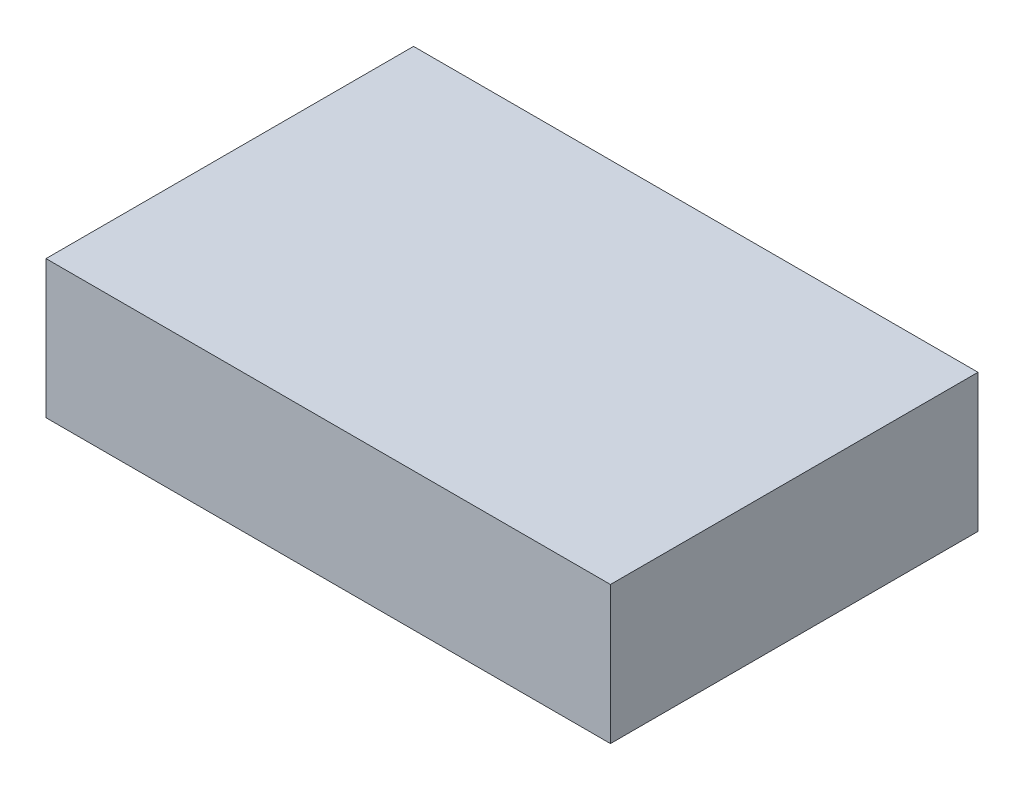
ISO-10303-21;
HEADER;
FILE_DESCRIPTION(('STEP AP214'),'2;1');
FILE_NAME('part.step','',(''),(''),'','','');
FILE_SCHEMA(('AUTOMOTIVE_DESIGN { 1 0 10303 214 1 1 1 1 }'));
ENDSEC;
DATA;
#1=APPLICATION_CONTEXT('core data for automotive mechanical design processes');
#2=APPLICATION_PROTOCOL_DEFINITION('international standard','automotive_design',2000,#1);
#3=PRODUCT_CONTEXT('',#1,'mechanical');
#4=PRODUCT('Part','Part','',(#3));
#5=PRODUCT_RELATED_PRODUCT_CATEGORY('part','',(#4));
#6=PRODUCT_DEFINITION_FORMATION('','',#4);
#7=PRODUCT_DEFINITION_CONTEXT('part definition',#1,'design');
#8=PRODUCT_DEFINITION('design','',#6,#7);
#9=PRODUCT_DEFINITION_SHAPE('','',#8);
#10=(LENGTH_UNIT() NAMED_UNIT(*) SI_UNIT(.MILLI.,.METRE.));
#11=(NAMED_UNIT(*) PLANE_ANGLE_UNIT() SI_UNIT($,.RADIAN.));
#12=(NAMED_UNIT(*) SI_UNIT($,.STERADIAN.) SOLID_ANGLE_UNIT());
#13=UNCERTAINTY_MEASURE_WITH_UNIT(LENGTH_MEASURE(1.E-05),#10,'distance_accuracy_value','');
#14=(GEOMETRIC_REPRESENTATION_CONTEXT(3) GLOBAL_UNCERTAINTY_ASSIGNED_CONTEXT((#13)) GLOBAL_UNIT_ASSIGNED_CONTEXT((#10,
#11,#12)) REPRESENTATION_CONTEXT('',''));
#15=CARTESIAN_POINT('',(0.,0.,0.));
#16=DIRECTION('',(0.,0.,1.));
#17=DIRECTION('',(1.,0.,0.));
#18=AXIS2_PLACEMENT_3D('',#15,#16,#17);
#19=CARTESIAN_POINT('',(43.,21.,28.));
#20=DIRECTION('',(-1.,0.,0.));
#21=DIRECTION('',(0.,0.,1.));
#22=AXIS2_PLACEMENT_3D('',#19,#20,#21);
#23=PLANE('',#22);
#24=DIRECTION('',(0.,0.,-1.));
#25=VECTOR('',#24,1.);
#26=CARTESIAN_POINT('',(43.,0.,28.));
#27=LINE('',#26,#25);
#28=CARTESIAN_POINT('',(43.,0.,28.));
#29=VERTEX_POINT('',#28);
#30=CARTESIAN_POINT('',(43.,0.,-28.));
#31=VERTEX_POINT('',#30);
#32=EDGE_CURVE('E96',#29,#31,#27,.T.);
#33=ORIENTED_EDGE('',*,*,#32,.T.);
#34=DIRECTION('',(0.,-1.,0.));
#35=VECTOR('',#34,1.);
#36=CARTESIAN_POINT('',(43.,21.,-28.));
#37=LINE('',#36,#35);
#38=CARTESIAN_POINT('',(43.,21.,-28.));
#39=VERTEX_POINT('',#38);
#40=EDGE_CURVE('E11',#39,#31,#37,.T.);
#41=ORIENTED_EDGE('',*,*,#40,.F.);
#42=DIRECTION('',(0.,0.,-1.));
#43=VECTOR('',#42,1.);
#44=CARTESIAN_POINT('',(43.,21.,28.));
#45=LINE('',#44,#43);
#46=CARTESIAN_POINT('',(43.,21.,28.));
#47=VERTEX_POINT('',#46);
#48=EDGE_CURVE('E84',#47,#39,#45,.T.);
#49=ORIENTED_EDGE('',*,*,#48,.F.);
#50=DIRECTION('',(0.,-1.,0.));
#51=VECTOR('',#50,1.);
#52=CARTESIAN_POINT('',(43.,21.,28.));
#53=LINE('',#52,#51);
#54=EDGE_CURVE('E92',#47,#29,#53,.T.);
#55=ORIENTED_EDGE('',*,*,#54,.T.);
#56=EDGE_LOOP('',(#33,#41,#49,#55));
#57=FACE_BOUND('',#56,.T.);
#58=ADVANCED_FACE('F33',(#57),#23,.F.);
#59=CARTESIAN_POINT('',(-43.,21.,-28.));
#60=DIRECTION('',(0.,0.,1.));
#61=DIRECTION('',(1.,0.,0.));
#62=AXIS2_PLACEMENT_3D('',#59,#60,#61);
#63=PLANE('',#62);
#64=DIRECTION('',(-1.,0.,0.));
#65=VECTOR('',#64,1.);
#66=CARTESIAN_POINT('',(-43.,0.,-28.));
#67=LINE('',#66,#65);
#68=CARTESIAN_POINT('',(-43.,0.,-28.));
#69=VERTEX_POINT('',#68);
#70=EDGE_CURVE('E88',#31,#69,#67,.T.);
#71=ORIENTED_EDGE('',*,*,#70,.T.);
#72=DIRECTION('',(0.,-1.,0.));
#73=VECTOR('',#72,1.);
#74=CARTESIAN_POINT('',(-43.,21.,-28.));
#75=LINE('',#74,#73);
#76=CARTESIAN_POINT('',(-43.,21.,-28.));
#77=VERTEX_POINT('',#76);
#78=EDGE_CURVE('E41',#77,#69,#75,.T.);
#79=ORIENTED_EDGE('',*,*,#78,.F.);
#80=DIRECTION('',(-1.,0.,0.));
#81=VECTOR('',#80,1.);
#82=CARTESIAN_POINT('',(-43.,21.,-28.));
#83=LINE('',#82,#81);
#84=EDGE_CURVE('E79',#39,#77,#83,.T.);
#85=ORIENTED_EDGE('',*,*,#84,.F.);
#86=ORIENTED_EDGE('',*,*,#40,.T.);
#87=EDGE_LOOP('',(#71,#79,#85,#86));
#88=FACE_BOUND('',#87,.T.);
#89=ADVANCED_FACE('F87',(#88),#63,.F.);
#90=CARTESIAN_POINT('',(-43.,21.,28.));
#91=DIRECTION('',(1.,0.,0.));
#92=DIRECTION('',(0.,0.,-1.));
#93=AXIS2_PLACEMENT_3D('',#90,#91,#92);
#94=PLANE('',#93);
#95=DIRECTION('',(0.,0.,1.));
#96=VECTOR('',#95,1.);
#97=CARTESIAN_POINT('',(-43.,0.,28.));
#98=LINE('',#97,#96);
#99=CARTESIAN_POINT('',(-43.,0.,28.));
#100=VERTEX_POINT('',#99);
#101=EDGE_CURVE('E66',#69,#100,#98,.T.);
#102=ORIENTED_EDGE('',*,*,#101,.T.);
#103=DIRECTION('',(0.,-1.,0.));
#104=VECTOR('',#103,1.);
#105=CARTESIAN_POINT('',(-43.,21.,28.));
#106=LINE('',#105,#104);
#107=CARTESIAN_POINT('',(-43.,21.,28.));
#108=VERTEX_POINT('',#107);
#109=EDGE_CURVE('E89',#108,#100,#106,.T.);
#110=ORIENTED_EDGE('',*,*,#109,.F.);
#111=DIRECTION('',(0.,0.,1.));
#112=VECTOR('',#111,1.);
#113=CARTESIAN_POINT('',(-43.,21.,28.));
#114=LINE('',#113,#112);
#115=EDGE_CURVE('E82',#77,#108,#114,.T.);
#116=ORIENTED_EDGE('',*,*,#115,.F.);
#117=ORIENTED_EDGE('',*,*,#78,.T.);
#118=EDGE_LOOP('',(#102,#110,#116,#117));
#119=FACE_BOUND('',#118,.T.);
#120=ADVANCED_FACE('F90',(#119),#94,.F.);
#121=CARTESIAN_POINT('',(-43.,21.,28.));
#122=DIRECTION('',(0.,0.,-1.));
#123=DIRECTION('',(-1.,0.,0.));
#124=AXIS2_PLACEMENT_3D('',#121,#122,#123);
#125=PLANE('',#124);
#126=DIRECTION('',(1.,0.,0.));
#127=VECTOR('',#126,1.);
#128=CARTESIAN_POINT('',(-43.,0.,28.));
#129=LINE('',#128,#127);
#130=EDGE_CURVE('E72',#100,#29,#129,.T.);
#131=ORIENTED_EDGE('',*,*,#130,.T.);
#132=ORIENTED_EDGE('',*,*,#54,.F.);
#133=DIRECTION('',(1.,0.,0.));
#134=VECTOR('',#133,1.);
#135=CARTESIAN_POINT('',(-43.,21.,28.));
#136=LINE('',#135,#134);
#137=EDGE_CURVE('E49',#108,#47,#136,.T.);
#138=ORIENTED_EDGE('',*,*,#137,.F.);
#139=ORIENTED_EDGE('',*,*,#109,.T.);
#140=EDGE_LOOP('',(#131,#132,#138,#139));
#141=FACE_BOUND('',#140,.T.);
#142=ADVANCED_FACE('F103',(#141),#125,.F.);
#143=CARTESIAN_POINT('',(43.,21.,-28.));
#144=DIRECTION('',(0.,-1.,0.));
#145=DIRECTION('',(0.,0.,-1.));
#146=AXIS2_PLACEMENT_3D('',#143,#144,#145);
#147=PLANE('',#146);
#148=ORIENTED_EDGE('',*,*,#48,.T.);
#149=ORIENTED_EDGE('',*,*,#84,.T.);
#150=ORIENTED_EDGE('',*,*,#115,.T.);
#151=ORIENTED_EDGE('',*,*,#137,.T.);
#152=EDGE_LOOP('',(#148,#149,#150,#151));
#153=FACE_BOUND('',#152,.T.);
#154=ADVANCED_FACE('F80',(#153),#147,.F.);
#155=CARTESIAN_POINT('',(43.,0.,-28.));
#156=DIRECTION('',(0.,-1.,0.));
#157=DIRECTION('',(0.,0.,-1.));
#158=AXIS2_PLACEMENT_3D('',#155,#156,#157);
#159=PLANE('',#158);
#160=ORIENTED_EDGE('',*,*,#32,.F.);
#161=ORIENTED_EDGE('',*,*,#130,.F.);
#162=ORIENTED_EDGE('',*,*,#101,.F.);
#163=ORIENTED_EDGE('',*,*,#70,.F.);
#164=EDGE_LOOP('',(#160,#161,#162,#163));
#165=FACE_BOUND('',#164,.T.);
#166=ADVANCED_FACE('F106',(#165),#159,.T.);
#167=CLOSED_SHELL('',(#58,#89,#120,#142,#154,#166));
#168=MANIFOLD_SOLID_BREP('B2',#167);
#169=ADVANCED_BREP_SHAPE_REPRESENTATION('',(#18,#168),#14);
#170=SHAPE_DEFINITION_REPRESENTATION(#9,#169);
ENDSEC;
END-ISO-10303-21;
